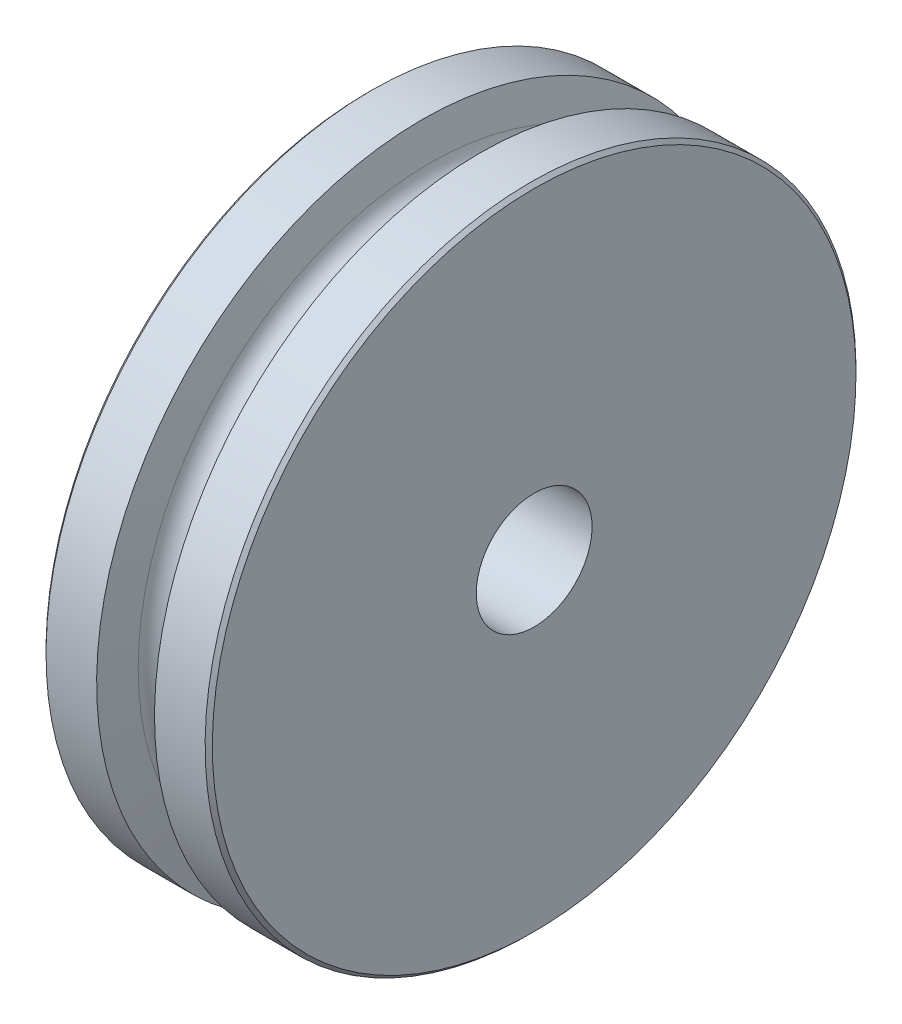
ISO-10303-21;
HEADER;
FILE_DESCRIPTION(('STEP AP214'),'2;1');
FILE_NAME('part.step','',(''),(''),'','','');
FILE_SCHEMA(('AUTOMOTIVE_DESIGN { 1 0 10303 214 1 1 1 1 }'));
ENDSEC;
DATA;
#1=APPLICATION_CONTEXT('core data for automotive mechanical design processes');
#2=APPLICATION_PROTOCOL_DEFINITION('international standard','automotive_design',2000,#1);
#3=PRODUCT_CONTEXT('',#1,'mechanical');
#4=PRODUCT('Part','Part','',(#3));
#5=PRODUCT_RELATED_PRODUCT_CATEGORY('part','',(#4));
#6=PRODUCT_DEFINITION_FORMATION('','',#4);
#7=PRODUCT_DEFINITION_CONTEXT('part definition',#1,'design');
#8=PRODUCT_DEFINITION('design','',#6,#7);
#9=PRODUCT_DEFINITION_SHAPE('','',#8);
#10=(LENGTH_UNIT() NAMED_UNIT(*) SI_UNIT(.MILLI.,.METRE.));
#11=(NAMED_UNIT(*) PLANE_ANGLE_UNIT() SI_UNIT($,.RADIAN.));
#12=(NAMED_UNIT(*) SI_UNIT($,.STERADIAN.) SOLID_ANGLE_UNIT());
#13=UNCERTAINTY_MEASURE_WITH_UNIT(LENGTH_MEASURE(1.E-05),#10,'distance_accuracy_value','');
#14=(GEOMETRIC_REPRESENTATION_CONTEXT(3) GLOBAL_UNCERTAINTY_ASSIGNED_CONTEXT((#13)) GLOBAL_UNIT_ASSIGNED_CONTEXT((#10,
#11,#12)) REPRESENTATION_CONTEXT('',''));
#15=CARTESIAN_POINT('',(0.,0.,0.));
#16=DIRECTION('',(0.,0.,1.));
#17=DIRECTION('',(1.,0.,0.));
#18=AXIS2_PLACEMENT_3D('',#15,#16,#17);
#19=CARTESIAN_POINT('',(18.25625,0.,0.));
#20=DIRECTION('',(1.,0.,0.));
#21=DIRECTION('',(0.,1.,0.));
#22=AXIS2_PLACEMENT_3D('',#19,#20,#21);
#23=CYLINDRICAL_SURFACE('',#22,71.4311499999998);
#24=CARTESIAN_POINT('',(-17.4625000000004,0.,0.));
#25=DIRECTION('',(1.,0.,0.));
#26=DIRECTION('',(0.,1.,0.));
#27=AXIS2_PLACEMENT_3D('',#24,#25,#26);
#28=CIRCLE('',#27,71.4311499999998);
#29=CARTESIAN_POINT('',(-17.4625,71.4311499999999,0.));
#30=VERTEX_POINT('',#29);
#31=EDGE_CURVE('E10',#30,#30,#28,.T.);
#32=ORIENTED_EDGE('',*,*,#31,.T.);
#33=EDGE_LOOP('',(#32));
#34=FACE_BOUND('',#33,.T.);
#35=CARTESIAN_POINT('',(-6.35000000000035,0.,0.));
#36=DIRECTION('',(1.,0.,0.));
#37=DIRECTION('',(0.,1.,0.));
#38=AXIS2_PLACEMENT_3D('',#35,#36,#37);
#39=CIRCLE('',#38,71.4311499999999);
#40=CARTESIAN_POINT('',(-6.35,71.4311499999999,0.));
#41=VERTEX_POINT('',#40);
#42=EDGE_CURVE('E431',#41,#41,#39,.T.);
#43=ORIENTED_EDGE('',*,*,#42,.F.);
#44=EDGE_LOOP('',(#43));
#45=FACE_BOUND('',#44,.T.);
#46=ADVANCED_FACE('F403',(#34,#45),#23,.T.);
#47=CARTESIAN_POINT('',(-17.4625000000004,0.,0.));
#48=DIRECTION('',(1.,0.,0.));
#49=DIRECTION('',(0.,1.,0.));
#50=AXIS2_PLACEMENT_3D('',#47,#48,#49);
#51=CONICAL_SURFACE('',#50,71.4311499999998,0.785398163397461);
#52=CARTESIAN_POINT('',(-18.2562500000003,0.,0.));
#53=DIRECTION('',(1.,0.,0.));
#54=DIRECTION('',(0.,1.,0.));
#55=AXIS2_PLACEMENT_3D('',#52,#53,#54);
#56=CIRCLE('',#55,70.6373999999998);
#57=CARTESIAN_POINT('',(-18.25625,70.6373999999999,0.));
#58=VERTEX_POINT('',#57);
#59=EDGE_CURVE('E409',#58,#58,#56,.T.);
#60=ORIENTED_EDGE('',*,*,#59,.T.);
#61=EDGE_LOOP('',(#60));
#62=FACE_BOUND('',#61,.T.);
#63=ORIENTED_EDGE('',*,*,#31,.F.);
#64=EDGE_LOOP('',(#63));
#65=FACE_BOUND('',#64,.T.);
#66=ADVANCED_FACE('F463',(#62,#65),#51,.T.);
#67=CARTESIAN_POINT('',(-18.2562499999998,70.6373999999999,0.));
#68=DIRECTION('',(-1.,0.,0.));
#69=DIRECTION('',(0.,-1.,0.));
#70=AXIS2_PLACEMENT_3D('',#67,#68,#69);
#71=PLANE('',#70);
#72=CARTESIAN_POINT('',(-18.2562500000004,0.,0.));
#73=DIRECTION('',(1.,0.,0.));
#74=DIRECTION('',(0.,1.,0.));
#75=AXIS2_PLACEMENT_3D('',#72,#73,#74);
#76=CIRCLE('',#75,12.7127);
#77=CARTESIAN_POINT('',(-18.2562500000003,12.7127000000001,0.));
#78=VERTEX_POINT('',#77);
#79=EDGE_CURVE('E434',#78,#78,#76,.T.);
#80=ORIENTED_EDGE('',*,*,#79,.T.);
#81=EDGE_LOOP('',(#80));
#82=FACE_BOUND('',#81,.T.);
#83=ORIENTED_EDGE('',*,*,#59,.F.);
#84=EDGE_LOOP('',(#83));
#85=FACE_BOUND('',#84,.T.);
#86=ADVANCED_FACE('F447',(#82,#85),#71,.T.);
#87=CARTESIAN_POINT('',(18.2562500000001,70.6373999999999,0.));
#88=DIRECTION('',(1.,0.,0.));
#89=DIRECTION('',(0.,1.,0.));
#90=AXIS2_PLACEMENT_3D('',#87,#88,#89);
#91=PLANE('',#90);
#92=CARTESIAN_POINT('',(18.2562499999997,0.,0.));
#93=DIRECTION('',(1.,0.,0.));
#94=DIRECTION('',(0.,1.,0.));
#95=AXIS2_PLACEMENT_3D('',#92,#93,#94);
#96=CIRCLE('',#95,12.7127);
#97=CARTESIAN_POINT('',(18.2562499999998,12.7126999999999,0.));
#98=VERTEX_POINT('',#97);
#99=EDGE_CURVE('E437',#98,#98,#96,.T.);
#100=ORIENTED_EDGE('',*,*,#99,.F.);
#101=EDGE_LOOP('',(#100));
#102=FACE_BOUND('',#101,.T.);
#103=CARTESIAN_POINT('',(18.2562499999995,0.,0.));
#104=DIRECTION('',(1.,0.,0.));
#105=DIRECTION('',(0.,1.,0.));
#106=AXIS2_PLACEMENT_3D('',#103,#104,#105);
#107=CIRCLE('',#106,70.6374);
#108=CARTESIAN_POINT('',(18.2562499999998,70.6373999999999,0.));
#109=VERTEX_POINT('',#108);
#110=EDGE_CURVE('E413',#109,#109,#107,.T.);
#111=ORIENTED_EDGE('',*,*,#110,.T.);
#112=EDGE_LOOP('',(#111));
#113=FACE_BOUND('',#112,.T.);
#114=ADVANCED_FACE('F443',(#102,#113),#91,.T.);
#115=CARTESIAN_POINT('',(18.2562499999995,0.,0.));
#116=DIRECTION('',(-1.,0.,0.));
#117=DIRECTION('',(0.,-1.,0.));
#118=AXIS2_PLACEMENT_3D('',#115,#116,#117);
#119=CONICAL_SURFACE('',#118,70.6374,0.785398163397433);
#120=CARTESIAN_POINT('',(17.4624999999995,0.,0.));
#121=DIRECTION('',(1.,0.,0.));
#122=DIRECTION('',(0.,1.,0.));
#123=AXIS2_PLACEMENT_3D('',#120,#121,#122);
#124=CIRCLE('',#123,71.43115);
#125=CARTESIAN_POINT('',(17.4624999999998,71.4311499999999,0.));
#126=VERTEX_POINT('',#125);
#127=EDGE_CURVE('E417',#126,#126,#124,.T.);
#128=ORIENTED_EDGE('',*,*,#127,.T.);
#129=EDGE_LOOP('',(#128));
#130=FACE_BOUND('',#129,.T.);
#131=ORIENTED_EDGE('',*,*,#110,.F.);
#132=EDGE_LOOP('',(#131));
#133=FACE_BOUND('',#132,.T.);
#134=ADVANCED_FACE('F446',(#130,#133),#119,.T.);
#135=CARTESIAN_POINT('',(18.25625,0.,0.));
#136=DIRECTION('',(1.,0.,0.));
#137=DIRECTION('',(0.,1.,0.));
#138=AXIS2_PLACEMENT_3D('',#135,#136,#137);
#139=CYLINDRICAL_SURFACE('',#138,71.4311499999999);
#140=CARTESIAN_POINT('',(6.34999999999965,0.,0.));
#141=DIRECTION('',(1.,0.,0.));
#142=DIRECTION('',(0.,1.,0.));
#143=AXIS2_PLACEMENT_3D('',#140,#141,#142);
#144=CIRCLE('',#143,71.4311499999999);
#145=CARTESIAN_POINT('',(6.35,71.4311499999999,0.));
#146=VERTEX_POINT('',#145);
#147=EDGE_CURVE('E422',#146,#146,#144,.T.);
#148=ORIENTED_EDGE('',*,*,#147,.T.);
#149=EDGE_LOOP('',(#148));
#150=FACE_BOUND('',#149,.T.);
#151=ORIENTED_EDGE('',*,*,#127,.F.);
#152=EDGE_LOOP('',(#151));
#153=FACE_BOUND('',#152,.T.);
#154=ADVANCED_FACE('F452',(#150,#153),#139,.T.);
#155=CARTESIAN_POINT('',(6.34999999999965,0.,0.));
#156=DIRECTION('',(1.,0.,0.));
#157=DIRECTION('',(0.,1.,0.));
#158=AXIS2_PLACEMENT_3D('',#155,#156,#157);
#159=CONICAL_SURFACE('',#158,71.4311499999999,1.34420065973755);
#160=CARTESIAN_POINT('',(4.64075555889562,0.,0.));
#161=DIRECTION('',(1.,0.,0.));
#162=DIRECTION('',(0.,1.,0.));
#163=AXIS2_PLACEMENT_3D('',#160,#161,#162);
#164=CIRCLE('',#163,64.0175494905948);
#165=CARTESIAN_POINT('',(4.64075555889594,64.0175494905947,0.));
#166=VERTEX_POINT('',#165);
#167=EDGE_CURVE('E425',#166,#166,#164,.T.);
#168=ORIENTED_EDGE('',*,*,#167,.T.);
#169=EDGE_LOOP('',(#168));
#170=FACE_BOUND('',#169,.T.);
#171=ORIENTED_EDGE('',*,*,#147,.F.);
#172=EDGE_LOOP('',(#171));
#173=FACE_BOUND('',#172,.T.);
#174=ADVANCED_FACE('F459',(#170,#173),#159,.T.);
#175=CARTESIAN_POINT('',(-3.22658566531686E-13,0.,0.));
#176=DIRECTION('',(1.,0.,0.));
#177=DIRECTION('',(0.,1.,0.));
#178=AXIS2_PLACEMENT_3D('',#175,#176,#177);
#179=TOROIDAL_SURFACE('',#178,65.0874999999999,4.7625);
#180=CARTESIAN_POINT('',(-4.64075555889625,0.,0.));
#181=DIRECTION('',(1.,0.,0.));
#182=DIRECTION('',(0.,1.,0.));
#183=AXIS2_PLACEMENT_3D('',#180,#181,#182);
#184=CIRCLE('',#183,64.0175494905947);
#185=CARTESIAN_POINT('',(-4.64075555889593,64.0175494905947,0.));
#186=VERTEX_POINT('',#185);
#187=EDGE_CURVE('E428',#186,#186,#184,.T.);
#188=ORIENTED_EDGE('',*,*,#187,.T.);
#189=EDGE_LOOP('',(#188));
#190=FACE_BOUND('',#189,.T.);
#191=ORIENTED_EDGE('',*,*,#167,.F.);
#192=EDGE_LOOP('',(#191));
#193=FACE_BOUND('',#192,.T.);
#194=ADVANCED_FACE('F472',(#190,#193),#179,.F.);
#195=CARTESIAN_POINT('',(-4.64075555889625,0.,0.));
#196=DIRECTION('',(-1.,0.,0.));
#197=DIRECTION('',(0.,-1.,0.));
#198=AXIS2_PLACEMENT_3D('',#195,#196,#197);
#199=CONICAL_SURFACE('',#198,64.0175494905947,1.34420065973754);
#200=ORIENTED_EDGE('',*,*,#42,.T.);
#201=EDGE_LOOP('',(#200));
#202=FACE_BOUND('',#201,.T.);
#203=ORIENTED_EDGE('',*,*,#187,.F.);
#204=EDGE_LOOP('',(#203));
#205=FACE_BOUND('',#204,.T.);
#206=ADVANCED_FACE('F469',(#202,#205),#199,.T.);
#207=CARTESIAN_POINT('',(-18.2562500000004,0.,0.));
#208=DIRECTION('',(1.,0.,0.));
#209=DIRECTION('',(0.,1.,0.));
#210=AXIS2_PLACEMENT_3D('',#207,#208,#209);
#211=CYLINDRICAL_SURFACE('',#210,12.7127);
#212=ORIENTED_EDGE('',*,*,#79,.F.);
#213=EDGE_LOOP('',(#212));
#214=FACE_BOUND('',#213,.T.);
#215=ORIENTED_EDGE('',*,*,#99,.T.);
#216=EDGE_LOOP('',(#215));
#217=FACE_BOUND('',#216,.T.);
#218=ADVANCED_FACE('F441',(#214,#217),#211,.F.);
#219=CLOSED_SHELL('',(#46,#66,#86,#114,#134,#154,#174,#194,#206,#218));
#220=MANIFOLD_SOLID_BREP('B2',#219);
#221=ADVANCED_BREP_SHAPE_REPRESENTATION('',(#18,#220),#14);
#222=SHAPE_DEFINITION_REPRESENTATION(#9,#221);
ENDSEC;
END-ISO-10303-21;
